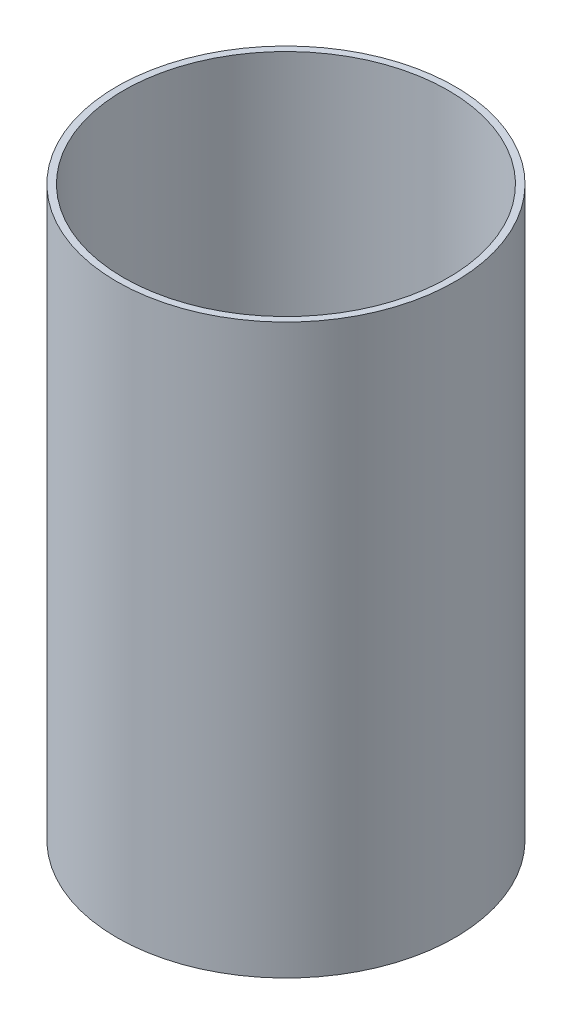
ISO-10303-21;
HEADER;
FILE_DESCRIPTION(('STEP AP214'),'2;1');
FILE_NAME('part.step','',(''),(''),'','','');
FILE_SCHEMA(('AUTOMOTIVE_DESIGN { 1 0 10303 214 1 1 1 1 }'));
ENDSEC;
DATA;
#1=APPLICATION_CONTEXT('core data for automotive mechanical design processes');
#2=APPLICATION_PROTOCOL_DEFINITION('international standard','automotive_design',2000,#1);
#3=PRODUCT_CONTEXT('',#1,'mechanical');
#4=PRODUCT('Part','Part','',(#3));
#5=PRODUCT_RELATED_PRODUCT_CATEGORY('part','',(#4));
#6=PRODUCT_DEFINITION_FORMATION('','',#4);
#7=PRODUCT_DEFINITION_CONTEXT('part definition',#1,'design');
#8=PRODUCT_DEFINITION('design','',#6,#7);
#9=PRODUCT_DEFINITION_SHAPE('','',#8);
#10=(LENGTH_UNIT() NAMED_UNIT(*) SI_UNIT(.MILLI.,.METRE.));
#11=(NAMED_UNIT(*) PLANE_ANGLE_UNIT() SI_UNIT($,.RADIAN.));
#12=(NAMED_UNIT(*) SI_UNIT($,.STERADIAN.) SOLID_ANGLE_UNIT());
#13=UNCERTAINTY_MEASURE_WITH_UNIT(LENGTH_MEASURE(1.E-05),#10,'distance_accuracy_value','');
#14=(GEOMETRIC_REPRESENTATION_CONTEXT(3) GLOBAL_UNCERTAINTY_ASSIGNED_CONTEXT((#13)) GLOBAL_UNIT_ASSIGNED_CONTEXT((#10,
#11,#12)) REPRESENTATION_CONTEXT('',''));
#15=CARTESIAN_POINT('',(0.,0.,0.));
#16=DIRECTION('',(0.,0.,1.));
#17=DIRECTION('',(1.,0.,0.));
#18=AXIS2_PLACEMENT_3D('',#15,#16,#17);
#19=CARTESIAN_POINT('',(0.,55.,0.));
#20=DIRECTION('',(0.,1.,0.));
#21=DIRECTION('',(0.,0.,1.));
#22=AXIS2_PLACEMENT_3D('',#19,#20,#21);
#23=CYLINDRICAL_SURFACE('',#22,39.6875);
#24=CARTESIAN_POINT('',(0.,-133.35,0.));
#25=DIRECTION('',(0.,1.,0.));
#26=DIRECTION('',(0.,0.,1.));
#27=AXIS2_PLACEMENT_3D('',#24,#25,#26);
#28=CIRCLE('',#27,39.6875);
#29=CARTESIAN_POINT('',(0.,-133.35,39.6875));
#30=VERTEX_POINT('',#29);
#31=EDGE_CURVE('E10',#30,#30,#28,.T.);
#32=ORIENTED_EDGE('',*,*,#31,.T.);
#33=EDGE_LOOP('',(#32));
#34=FACE_BOUND('',#33,.T.);
#35=CARTESIAN_POINT('',(0.,0.,0.));
#36=DIRECTION('',(0.,1.,0.));
#37=DIRECTION('',(0.,0.,1.));
#38=AXIS2_PLACEMENT_3D('',#35,#36,#37);
#39=CIRCLE('',#38,39.6875);
#40=CARTESIAN_POINT('',(0.,0.,39.6875));
#41=VERTEX_POINT('',#40);
#42=EDGE_CURVE('E46',#41,#41,#39,.T.);
#43=ORIENTED_EDGE('',*,*,#42,.F.);
#44=EDGE_LOOP('',(#43));
#45=FACE_BOUND('',#44,.T.);
#46=ADVANCED_FACE('F32',(#34,#45),#23,.T.);
#47=CARTESIAN_POINT('',(-39.6875,-133.35,0.));
#48=DIRECTION('',(0.,-1.,0.));
#49=DIRECTION('',(0.,0.,-1.));
#50=AXIS2_PLACEMENT_3D('',#47,#48,#49);
#51=PLANE('',#50);
#52=CARTESIAN_POINT('',(0.,-133.35,0.));
#53=DIRECTION('',(0.,1.,0.));
#54=DIRECTION('',(0.,0.,1.));
#55=AXIS2_PLACEMENT_3D('',#52,#53,#54);
#56=CIRCLE('',#55,38.1);
#57=CARTESIAN_POINT('',(0.,-133.35,38.1));
#58=VERTEX_POINT('',#57);
#59=EDGE_CURVE('E38',#58,#58,#56,.T.);
#60=ORIENTED_EDGE('',*,*,#59,.T.);
#61=EDGE_LOOP('',(#60));
#62=FACE_BOUND('',#61,.T.);
#63=ORIENTED_EDGE('',*,*,#31,.F.);
#64=EDGE_LOOP('',(#63));
#65=FACE_BOUND('',#64,.T.);
#66=ADVANCED_FACE('F56',(#62,#65),#51,.T.);
#67=CARTESIAN_POINT('',(0.,55.,0.));
#68=DIRECTION('',(0.,1.,0.));
#69=DIRECTION('',(0.,0.,1.));
#70=AXIS2_PLACEMENT_3D('',#67,#68,#69);
#71=CYLINDRICAL_SURFACE('',#70,38.1);
#72=CARTESIAN_POINT('',(0.,0.,0.));
#73=DIRECTION('',(0.,1.,0.));
#74=DIRECTION('',(0.,0.,1.));
#75=AXIS2_PLACEMENT_3D('',#72,#73,#74);
#76=CIRCLE('',#75,38.1);
#77=CARTESIAN_POINT('',(0.,0.,38.1));
#78=VERTEX_POINT('',#77);
#79=EDGE_CURVE('E42',#78,#78,#76,.T.);
#80=ORIENTED_EDGE('',*,*,#79,.T.);
#81=EDGE_LOOP('',(#80));
#82=FACE_BOUND('',#81,.T.);
#83=ORIENTED_EDGE('',*,*,#59,.F.);
#84=EDGE_LOOP('',(#83));
#85=FACE_BOUND('',#84,.T.);
#86=ADVANCED_FACE('F60',(#82,#85),#71,.F.);
#87=CARTESIAN_POINT('',(-39.6875,0.,0.));
#88=DIRECTION('',(0.,1.,0.));
#89=DIRECTION('',(0.,0.,1.));
#90=AXIS2_PLACEMENT_3D('',#87,#88,#89);
#91=PLANE('',#90);
#92=ORIENTED_EDGE('',*,*,#42,.T.);
#93=EDGE_LOOP('',(#92));
#94=FACE_BOUND('',#93,.T.);
#95=ORIENTED_EDGE('',*,*,#79,.F.);
#96=EDGE_LOOP('',(#95));
#97=FACE_BOUND('',#96,.T.);
#98=ADVANCED_FACE('F52',(#94,#97),#91,.T.);
#99=CLOSED_SHELL('',(#46,#66,#86,#98));
#100=MANIFOLD_SOLID_BREP('B2',#99);
#101=ADVANCED_BREP_SHAPE_REPRESENTATION('',(#18,#100),#14);
#102=SHAPE_DEFINITION_REPRESENTATION(#9,#101);
ENDSEC;
END-ISO-10303-21;
